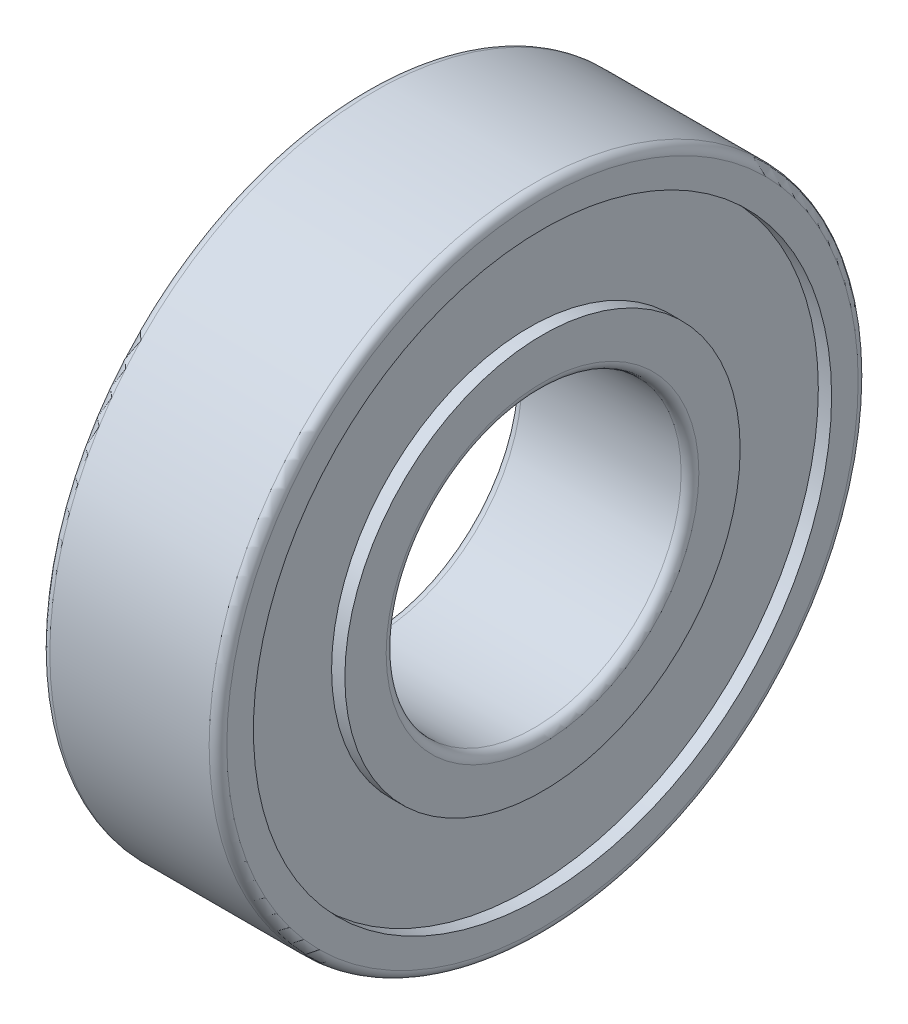
ISO-10303-21;
HEADER;
FILE_DESCRIPTION(('STEP AP214'),'2;1');
FILE_NAME('part.step','',(''),(''),'','','');
FILE_SCHEMA(('AUTOMOTIVE_DESIGN { 1 0 10303 214 1 1 1 1 }'));
ENDSEC;
DATA;
#1=APPLICATION_CONTEXT('core data for automotive mechanical design processes');
#2=APPLICATION_PROTOCOL_DEFINITION('international standard','automotive_design',2000,#1);
#3=PRODUCT_CONTEXT('',#1,'mechanical');
#4=PRODUCT('Part','Part','',(#3));
#5=PRODUCT_RELATED_PRODUCT_CATEGORY('part','',(#4));
#6=PRODUCT_DEFINITION_FORMATION('','',#4);
#7=PRODUCT_DEFINITION_CONTEXT('part definition',#1,'design');
#8=PRODUCT_DEFINITION('design','',#6,#7);
#9=PRODUCT_DEFINITION_SHAPE('','',#8);
#10=(LENGTH_UNIT() NAMED_UNIT(*) SI_UNIT(.MILLI.,.METRE.));
#11=(NAMED_UNIT(*) PLANE_ANGLE_UNIT() SI_UNIT($,.RADIAN.));
#12=(NAMED_UNIT(*) SI_UNIT($,.STERADIAN.) SOLID_ANGLE_UNIT());
#13=UNCERTAINTY_MEASURE_WITH_UNIT(LENGTH_MEASURE(1.E-05),#10,'distance_accuracy_value','');
#14=(GEOMETRIC_REPRESENTATION_CONTEXT(3) GLOBAL_UNCERTAINTY_ASSIGNED_CONTEXT((#13)) GLOBAL_UNIT_ASSIGNED_CONTEXT((#10,
#11,#12)) REPRESENTATION_CONTEXT('',''));
#15=CARTESIAN_POINT('',(0.,0.,0.));
#16=DIRECTION('',(0.,0.,1.));
#17=DIRECTION('',(1.,0.,0.));
#18=AXIS2_PLACEMENT_3D('',#15,#16,#17);
#19=CARTESIAN_POINT('',(0.3,0.,0.));
#20=DIRECTION('',(1.,0.,0.));
#21=DIRECTION('',(0.,0.,-1.));
#22=AXIS2_PLACEMENT_3D('',#19,#20,#21);
#23=TOROIDAL_SURFACE('',#22,5.3,0.3);
#24=CARTESIAN_POINT('',(0.3,0.,0.));
#25=DIRECTION('',(1.,0.,0.));
#26=DIRECTION('',(0.,0.,-1.));
#27=AXIS2_PLACEMENT_3D('',#24,#25,#26);
#28=CIRCLE('',#27,5.);
#29=CARTESIAN_POINT('',(0.3,0.,-5.));
#30=VERTEX_POINT('',#29);
#31=EDGE_CURVE('E10',#30,#30,#28,.T.);
#32=ORIENTED_EDGE('',*,*,#31,.T.);
#33=EDGE_LOOP('',(#32));
#34=FACE_BOUND('',#33,.T.);
#35=CARTESIAN_POINT('',(0.,0.,0.));
#36=DIRECTION('',(1.,0.,0.));
#37=DIRECTION('',(0.,0.,-1.));
#38=AXIS2_PLACEMENT_3D('',#35,#36,#37);
#39=CIRCLE('',#38,5.3);
#40=CARTESIAN_POINT('',(0.,0.,-5.3));
#41=VERTEX_POINT('',#40);
#42=EDGE_CURVE('E82',#41,#41,#39,.T.);
#43=ORIENTED_EDGE('',*,*,#42,.F.);
#44=EDGE_LOOP('',(#43));
#45=FACE_BOUND('',#44,.T.);
#46=ADVANCED_FACE('F30',(#34,#45),#23,.T.);
#47=CARTESIAN_POINT('',(-0.00125399362039863,0.,0.));
#48=DIRECTION('',(1.,0.,0.));
#49=DIRECTION('',(0.,0.,-1.));
#50=AXIS2_PLACEMENT_3D('',#47,#48,#49);
#51=CYLINDRICAL_SURFACE('',#50,5.);
#52=CARTESIAN_POINT('',(5.7,0.,0.));
#53=DIRECTION('',(1.,0.,0.));
#54=DIRECTION('',(0.,0.,-1.));
#55=AXIS2_PLACEMENT_3D('',#52,#53,#54);
#56=CIRCLE('',#55,5.);
#57=CARTESIAN_POINT('',(5.7,0.,-5.));
#58=VERTEX_POINT('',#57);
#59=EDGE_CURVE('E36',#58,#58,#56,.T.);
#60=ORIENTED_EDGE('',*,*,#59,.T.);
#61=EDGE_LOOP('',(#60));
#62=FACE_BOUND('',#61,.T.);
#63=ORIENTED_EDGE('',*,*,#31,.F.);
#64=EDGE_LOOP('',(#63));
#65=FACE_BOUND('',#64,.T.);
#66=ADVANCED_FACE('F90',(#62,#65),#51,.F.);
#67=CARTESIAN_POINT('',(5.7,0.,0.));
#68=DIRECTION('',(1.,0.,0.));
#69=DIRECTION('',(0.,0.,-1.));
#70=AXIS2_PLACEMENT_3D('',#67,#68,#69);
#71=TOROIDAL_SURFACE('',#70,5.3,0.3);
#72=CARTESIAN_POINT('',(6.,0.,0.));
#73=DIRECTION('',(1.,0.,0.));
#74=DIRECTION('',(0.,0.,-1.));
#75=AXIS2_PLACEMENT_3D('',#72,#73,#74);
#76=CIRCLE('',#75,5.3);
#77=CARTESIAN_POINT('',(6.,0.,-5.3));
#78=VERTEX_POINT('',#77);
#79=EDGE_CURVE('E40',#78,#78,#76,.T.);
#80=ORIENTED_EDGE('',*,*,#79,.T.);
#81=EDGE_LOOP('',(#80));
#82=FACE_BOUND('',#81,.T.);
#83=ORIENTED_EDGE('',*,*,#59,.F.);
#84=EDGE_LOOP('',(#83));
#85=FACE_BOUND('',#84,.T.);
#86=ADVANCED_FACE('F94',(#82,#85),#71,.T.);
#87=CARTESIAN_POINT('',(6.,5.3,0.));
#88=DIRECTION('',(1.,0.,0.));
#89=DIRECTION('',(0.,0.,-1.));
#90=AXIS2_PLACEMENT_3D('',#87,#88,#89);
#91=PLANE('',#90);
#92=CARTESIAN_POINT('',(6.,0.,0.));
#93=DIRECTION('',(1.,0.,0.));
#94=DIRECTION('',(0.,0.,-1.));
#95=AXIS2_PLACEMENT_3D('',#92,#93,#94);
#96=CIRCLE('',#95,6.7);
#97=CARTESIAN_POINT('',(6.,0.,-6.7));
#98=VERTEX_POINT('',#97);
#99=EDGE_CURVE('E44',#98,#98,#96,.T.);
#100=ORIENTED_EDGE('',*,*,#99,.T.);
#101=EDGE_LOOP('',(#100));
#102=FACE_BOUND('',#101,.T.);
#103=ORIENTED_EDGE('',*,*,#79,.F.);
#104=EDGE_LOOP('',(#103));
#105=FACE_BOUND('',#104,.T.);
#106=ADVANCED_FACE('F98',(#102,#105),#91,.T.);
#107=CARTESIAN_POINT('',(-0.00125399362039863,0.,0.));
#108=DIRECTION('',(1.,0.,0.));
#109=DIRECTION('',(0.,0.,-1.));
#110=AXIS2_PLACEMENT_3D('',#107,#108,#109);
#111=CYLINDRICAL_SURFACE('',#110,6.7);
#112=CARTESIAN_POINT('',(5.55,0.,0.));
#113=DIRECTION('',(1.,0.,0.));
#114=DIRECTION('',(0.,0.,-1.));
#115=AXIS2_PLACEMENT_3D('',#112,#113,#114);
#116=CIRCLE('',#115,6.7);
#117=CARTESIAN_POINT('',(5.55,0.,-6.7));
#118=VERTEX_POINT('',#117);
#119=EDGE_CURVE('E49',#118,#118,#116,.T.);
#120=ORIENTED_EDGE('',*,*,#119,.T.);
#121=EDGE_LOOP('',(#120));
#122=FACE_BOUND('',#121,.T.);
#123=ORIENTED_EDGE('',*,*,#99,.F.);
#124=EDGE_LOOP('',(#123));
#125=FACE_BOUND('',#124,.T.);
#126=ADVANCED_FACE('F105',(#122,#125),#111,.T.);
#127=CARTESIAN_POINT('',(5.55,6.7,0.));
#128=DIRECTION('',(1.,0.,0.));
#129=DIRECTION('',(0.,0.,-1.));
#130=AXIS2_PLACEMENT_3D('',#127,#128,#129);
#131=PLANE('',#130);
#132=CARTESIAN_POINT('',(5.55,0.,0.));
#133=DIRECTION('',(1.,0.,0.));
#134=DIRECTION('',(0.,0.,-1.));
#135=AXIS2_PLACEMENT_3D('',#132,#133,#134);
#136=CIRCLE('',#135,9.8);
#137=CARTESIAN_POINT('',(5.55,0.,-9.8));
#138=VERTEX_POINT('',#137);
#139=EDGE_CURVE('E52',#138,#138,#136,.T.);
#140=ORIENTED_EDGE('',*,*,#139,.T.);
#141=EDGE_LOOP('',(#140));
#142=FACE_BOUND('',#141,.T.);
#143=ORIENTED_EDGE('',*,*,#119,.F.);
#144=EDGE_LOOP('',(#143));
#145=FACE_BOUND('',#144,.T.);
#146=ADVANCED_FACE('F109',(#142,#145),#131,.T.);
#147=CARTESIAN_POINT('',(-0.00125399362039863,0.,0.));
#148=DIRECTION('',(1.,0.,0.));
#149=DIRECTION('',(0.,0.,-1.));
#150=AXIS2_PLACEMENT_3D('',#147,#148,#149);
#151=CYLINDRICAL_SURFACE('',#150,9.8);
#152=CARTESIAN_POINT('',(6.,0.,0.));
#153=DIRECTION('',(1.,0.,0.));
#154=DIRECTION('',(0.,0.,-1.));
#155=AXIS2_PLACEMENT_3D('',#152,#153,#154);
#156=CIRCLE('',#155,9.8);
#157=CARTESIAN_POINT('',(6.,0.,-9.8));
#158=VERTEX_POINT('',#157);
#159=EDGE_CURVE('E55',#158,#158,#156,.T.);
#160=ORIENTED_EDGE('',*,*,#159,.T.);
#161=EDGE_LOOP('',(#160));
#162=FACE_BOUND('',#161,.T.);
#163=ORIENTED_EDGE('',*,*,#139,.F.);
#164=EDGE_LOOP('',(#163));
#165=FACE_BOUND('',#164,.T.);
#166=ADVANCED_FACE('F113',(#162,#165),#151,.F.);
#167=CARTESIAN_POINT('',(6.,9.8,0.));
#168=DIRECTION('',(1.,0.,0.));
#169=DIRECTION('',(0.,0.,-1.));
#170=AXIS2_PLACEMENT_3D('',#167,#168,#169);
#171=PLANE('',#170);
#172=CARTESIAN_POINT('',(6.,0.,0.));
#173=DIRECTION('',(1.,0.,0.));
#174=DIRECTION('',(0.,0.,-1.));
#175=AXIS2_PLACEMENT_3D('',#172,#173,#174);
#176=CIRCLE('',#175,10.7);
#177=CARTESIAN_POINT('',(6.,0.,-10.7));
#178=VERTEX_POINT('',#177);
#179=EDGE_CURVE('E58',#178,#178,#176,.T.);
#180=ORIENTED_EDGE('',*,*,#179,.T.);
#181=EDGE_LOOP('',(#180));
#182=FACE_BOUND('',#181,.T.);
#183=ORIENTED_EDGE('',*,*,#159,.F.);
#184=EDGE_LOOP('',(#183));
#185=FACE_BOUND('',#184,.T.);
#186=ADVANCED_FACE('F117',(#182,#185),#171,.T.);
#187=CARTESIAN_POINT('',(5.7,0.,0.));
#188=DIRECTION('',(1.,0.,0.));
#189=DIRECTION('',(0.,0.,-1.));
#190=AXIS2_PLACEMENT_3D('',#187,#188,#189);
#191=TOROIDAL_SURFACE('',#190,10.7,0.3);
#192=CARTESIAN_POINT('',(5.7,0.,0.));
#193=DIRECTION('',(1.,0.,0.));
#194=DIRECTION('',(0.,0.,-1.));
#195=AXIS2_PLACEMENT_3D('',#192,#193,#194);
#196=CIRCLE('',#195,11.);
#197=CARTESIAN_POINT('',(5.7,0.,-11.));
#198=VERTEX_POINT('',#197);
#199=EDGE_CURVE('E61',#198,#198,#196,.T.);
#200=ORIENTED_EDGE('',*,*,#199,.T.);
#201=EDGE_LOOP('',(#200));
#202=FACE_BOUND('',#201,.T.);
#203=ORIENTED_EDGE('',*,*,#179,.F.);
#204=EDGE_LOOP('',(#203));
#205=FACE_BOUND('',#204,.T.);
#206=ADVANCED_FACE('F121',(#202,#205),#191,.T.);
#207=CARTESIAN_POINT('',(-0.00125399362039863,0.,0.));
#208=DIRECTION('',(1.,0.,0.));
#209=DIRECTION('',(0.,0.,-1.));
#210=AXIS2_PLACEMENT_3D('',#207,#208,#209);
#211=CYLINDRICAL_SURFACE('',#210,11.);
#212=CARTESIAN_POINT('',(0.3,0.,0.));
#213=DIRECTION('',(1.,0.,0.));
#214=DIRECTION('',(0.,0.,-1.));
#215=AXIS2_PLACEMENT_3D('',#212,#213,#214);
#216=CIRCLE('',#215,11.);
#217=CARTESIAN_POINT('',(0.3,0.,-11.));
#218=VERTEX_POINT('',#217);
#219=EDGE_CURVE('E64',#218,#218,#216,.T.);
#220=ORIENTED_EDGE('',*,*,#219,.T.);
#221=EDGE_LOOP('',(#220));
#222=FACE_BOUND('',#221,.T.);
#223=ORIENTED_EDGE('',*,*,#199,.F.);
#224=EDGE_LOOP('',(#223));
#225=FACE_BOUND('',#224,.T.);
#226=ADVANCED_FACE('F125',(#222,#225),#211,.T.);
#227=CARTESIAN_POINT('',(0.300000000000002,0.,0.));
#228=DIRECTION('',(1.,0.,0.));
#229=DIRECTION('',(0.,0.,-1.));
#230=AXIS2_PLACEMENT_3D('',#227,#228,#229);
#231=TOROIDAL_SURFACE('',#230,10.7,0.300000000000001);
#232=CARTESIAN_POINT('',(0.,0.,0.));
#233=DIRECTION('',(1.,0.,0.));
#234=DIRECTION('',(0.,0.,-1.));
#235=AXIS2_PLACEMENT_3D('',#232,#233,#234);
#236=CIRCLE('',#235,10.7);
#237=CARTESIAN_POINT('',(0.,0.,-10.7));
#238=VERTEX_POINT('',#237);
#239=EDGE_CURVE('E67',#238,#238,#236,.T.);
#240=ORIENTED_EDGE('',*,*,#239,.T.);
#241=EDGE_LOOP('',(#240));
#242=FACE_BOUND('',#241,.T.);
#243=ORIENTED_EDGE('',*,*,#219,.F.);
#244=EDGE_LOOP('',(#243));
#245=FACE_BOUND('',#244,.T.);
#246=ADVANCED_FACE('F129',(#242,#245),#231,.T.);
#247=CARTESIAN_POINT('',(0.,10.7,0.));
#248=DIRECTION('',(-1.,0.,0.));
#249=DIRECTION('',(0.,0.,1.));
#250=AXIS2_PLACEMENT_3D('',#247,#248,#249);
#251=PLANE('',#250);
#252=CARTESIAN_POINT('',(0.,0.,0.));
#253=DIRECTION('',(1.,0.,0.));
#254=DIRECTION('',(0.,0.,-1.));
#255=AXIS2_PLACEMENT_3D('',#252,#253,#254);
#256=CIRCLE('',#255,9.8);
#257=CARTESIAN_POINT('',(0.,0.,-9.8));
#258=VERTEX_POINT('',#257);
#259=EDGE_CURVE('E70',#258,#258,#256,.T.);
#260=ORIENTED_EDGE('',*,*,#259,.T.);
#261=EDGE_LOOP('',(#260));
#262=FACE_BOUND('',#261,.T.);
#263=ORIENTED_EDGE('',*,*,#239,.F.);
#264=EDGE_LOOP('',(#263));
#265=FACE_BOUND('',#264,.T.);
#266=ADVANCED_FACE('F133',(#262,#265),#251,.T.);
#267=CARTESIAN_POINT('',(-0.00125399362039863,0.,0.));
#268=DIRECTION('',(1.,0.,0.));
#269=DIRECTION('',(0.,0.,-1.));
#270=AXIS2_PLACEMENT_3D('',#267,#268,#269);
#271=CYLINDRICAL_SURFACE('',#270,9.8);
#272=CARTESIAN_POINT('',(0.45,0.,0.));
#273=DIRECTION('',(1.,0.,0.));
#274=DIRECTION('',(0.,0.,-1.));
#275=AXIS2_PLACEMENT_3D('',#272,#273,#274);
#276=CIRCLE('',#275,9.8);
#277=CARTESIAN_POINT('',(0.45,0.,-9.8));
#278=VERTEX_POINT('',#277);
#279=EDGE_CURVE('E73',#278,#278,#276,.T.);
#280=ORIENTED_EDGE('',*,*,#279,.T.);
#281=EDGE_LOOP('',(#280));
#282=FACE_BOUND('',#281,.T.);
#283=ORIENTED_EDGE('',*,*,#259,.F.);
#284=EDGE_LOOP('',(#283));
#285=FACE_BOUND('',#284,.T.);
#286=ADVANCED_FACE('F137',(#282,#285),#271,.F.);
#287=CARTESIAN_POINT('',(0.45,9.8,0.));
#288=DIRECTION('',(-1.,0.,0.));
#289=DIRECTION('',(0.,0.,1.));
#290=AXIS2_PLACEMENT_3D('',#287,#288,#289);
#291=PLANE('',#290);
#292=CARTESIAN_POINT('',(0.45,0.,0.));
#293=DIRECTION('',(1.,0.,0.));
#294=DIRECTION('',(0.,0.,-1.));
#295=AXIS2_PLACEMENT_3D('',#292,#293,#294);
#296=CIRCLE('',#295,6.7);
#297=CARTESIAN_POINT('',(0.45,0.,-6.7));
#298=VERTEX_POINT('',#297);
#299=EDGE_CURVE('E76',#298,#298,#296,.T.);
#300=ORIENTED_EDGE('',*,*,#299,.T.);
#301=EDGE_LOOP('',(#300));
#302=FACE_BOUND('',#301,.T.);
#303=ORIENTED_EDGE('',*,*,#279,.F.);
#304=EDGE_LOOP('',(#303));
#305=FACE_BOUND('',#304,.T.);
#306=ADVANCED_FACE('F141',(#302,#305),#291,.T.);
#307=CARTESIAN_POINT('',(-0.00125399362039863,0.,0.));
#308=DIRECTION('',(1.,0.,0.));
#309=DIRECTION('',(0.,0.,-1.));
#310=AXIS2_PLACEMENT_3D('',#307,#308,#309);
#311=CYLINDRICAL_SURFACE('',#310,6.7);
#312=CARTESIAN_POINT('',(0.,0.,0.));
#313=DIRECTION('',(1.,0.,0.));
#314=DIRECTION('',(0.,0.,-1.));
#315=AXIS2_PLACEMENT_3D('',#312,#313,#314);
#316=CIRCLE('',#315,6.7);
#317=CARTESIAN_POINT('',(0.,0.,-6.7));
#318=VERTEX_POINT('',#317);
#319=EDGE_CURVE('E79',#318,#318,#316,.T.);
#320=ORIENTED_EDGE('',*,*,#319,.T.);
#321=EDGE_LOOP('',(#320));
#322=FACE_BOUND('',#321,.T.);
#323=ORIENTED_EDGE('',*,*,#299,.F.);
#324=EDGE_LOOP('',(#323));
#325=FACE_BOUND('',#324,.T.);
#326=ADVANCED_FACE('F145',(#322,#325),#311,.T.);
#327=CARTESIAN_POINT('',(0.,6.7,0.));
#328=DIRECTION('',(-1.,0.,0.));
#329=DIRECTION('',(0.,0.,1.));
#330=AXIS2_PLACEMENT_3D('',#327,#328,#329);
#331=PLANE('',#330);
#332=ORIENTED_EDGE('',*,*,#42,.T.);
#333=EDGE_LOOP('',(#332));
#334=FACE_BOUND('',#333,.T.);
#335=ORIENTED_EDGE('',*,*,#319,.F.);
#336=EDGE_LOOP('',(#335));
#337=FACE_BOUND('',#336,.T.);
#338=ADVANCED_FACE('F86',(#334,#337),#331,.T.);
#339=CLOSED_SHELL('',(#46,#66,#86,#106,#126,#146,#166,#186,#206,#226,#246,#266,#286,#306,#326,#338));
#340=MANIFOLD_SOLID_BREP('B2',#339);
#341=ADVANCED_BREP_SHAPE_REPRESENTATION('',(#18,#340),#14);
#342=SHAPE_DEFINITION_REPRESENTATION(#9,#341);
ENDSEC;
END-ISO-10303-21;
